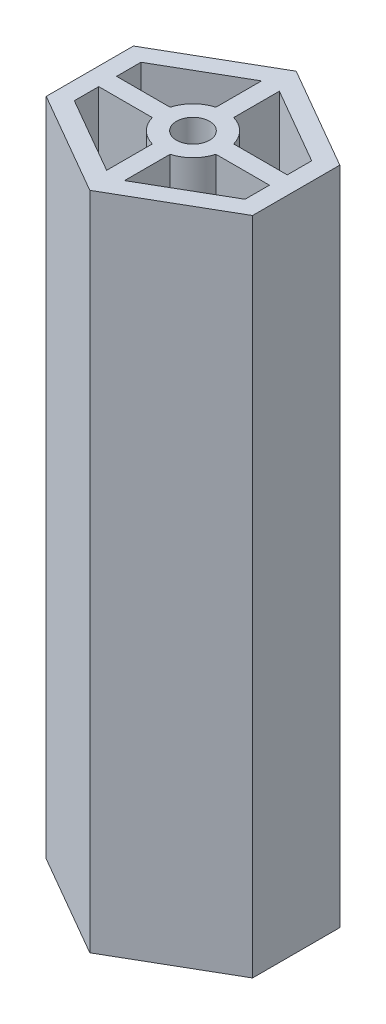
ISO-10303-21;
HEADER;
FILE_DESCRIPTION(('STEP AP214'),'2;1');
FILE_NAME('part.step','',(''),(''),'','','');
FILE_SCHEMA(('AUTOMOTIVE_DESIGN { 1 0 10303 214 1 1 1 1 }'));
ENDSEC;
DATA;
#1=APPLICATION_CONTEXT('core data for automotive mechanical design processes');
#2=APPLICATION_PROTOCOL_DEFINITION('international standard','automotive_design',2000,#1);
#3=PRODUCT_CONTEXT('',#1,'mechanical');
#4=PRODUCT('Part','Part','',(#3));
#5=PRODUCT_RELATED_PRODUCT_CATEGORY('part','',(#4));
#6=PRODUCT_DEFINITION_FORMATION('','',#4);
#7=PRODUCT_DEFINITION_CONTEXT('part definition',#1,'design');
#8=PRODUCT_DEFINITION('design','',#6,#7);
#9=PRODUCT_DEFINITION_SHAPE('','',#8);
#10=(LENGTH_UNIT() NAMED_UNIT(*) SI_UNIT(.MILLI.,.METRE.));
#11=(NAMED_UNIT(*) PLANE_ANGLE_UNIT() SI_UNIT($,.RADIAN.));
#12=(NAMED_UNIT(*) SI_UNIT($,.STERADIAN.) SOLID_ANGLE_UNIT());
#13=UNCERTAINTY_MEASURE_WITH_UNIT(LENGTH_MEASURE(1.E-05),#10,'distance_accuracy_value','');
#14=(GEOMETRIC_REPRESENTATION_CONTEXT(3) GLOBAL_UNCERTAINTY_ASSIGNED_CONTEXT((#13)) GLOBAL_UNIT_ASSIGNED_CONTEXT((#10,
#11,#12)) REPRESENTATION_CONTEXT('',''));
#15=CARTESIAN_POINT('',(0.,0.,0.));
#16=DIRECTION('',(0.,0.,1.));
#17=DIRECTION('',(1.,0.,0.));
#18=AXIS2_PLACEMENT_3D('',#15,#16,#17);
#19=CARTESIAN_POINT('',(0.,80.,0.));
#20=DIRECTION('',(0.,1.,0.));
#21=DIRECTION('',(0.,0.,1.));
#22=AXIS2_PLACEMENT_3D('',#19,#20,#21);
#23=PLANE('',#22);
#24=DIRECTION('',(0.,0.,-1.));
#25=VECTOR('',#24,1.);
#26=CARTESIAN_POINT('',(10.34,80.,1.08));
#27=LINE('',#26,#25);
#28=CARTESIAN_POINT('',(10.34,80.,4.03604505368013));
#29=VERTEX_POINT('',#28);
#30=CARTESIAN_POINT('',(10.34,80.,1.08));
#31=VERTEX_POINT('',#30);
#32=EDGE_CURVE('E218',#29,#31,#27,.T.);
#33=ORIENTED_EDGE('',*,*,#32,.F.);
#34=DIRECTION('',(0.866025403784439,0.,-0.5));
#35=VECTOR('',#34,1.);
#36=CARTESIAN_POINT('',(10.34,80.,4.03604505368013));
#37=LINE('',#36,#35);
#38=CARTESIAN_POINT('',(1.08,80.,9.38230854637606));
#39=VERTEX_POINT('',#38);
#40=EDGE_CURVE('E210',#39,#29,#37,.T.);
#41=ORIENTED_EDGE('',*,*,#40,.F.);
#42=DIRECTION('',(0.,0.,1.));
#43=VECTOR('',#42,1.);
#44=CARTESIAN_POINT('',(1.08,80.,3.85144128866065));
#45=LINE('',#44,#43);
#46=CARTESIAN_POINT('',(1.08,80.,3.85144128866065));
#47=VERTEX_POINT('',#46);
#48=EDGE_CURVE('E239',#47,#39,#45,.T.);
#49=ORIENTED_EDGE('',*,*,#48,.F.);
#50=CARTESIAN_POINT('',(0.,80.,0.));
#51=DIRECTION('',(0.,-1.,0.));
#52=DIRECTION('',(0.,0.,1.));
#53=AXIS2_PLACEMENT_3D('',#50,#51,#52);
#54=CIRCLE('',#53,4.);
#55=CARTESIAN_POINT('',(3.85144128866065,80.,1.08));
#56=VERTEX_POINT('',#55);
#57=EDGE_CURVE('E234',#56,#47,#54,.T.);
#58=ORIENTED_EDGE('',*,*,#57,.F.);
#59=DIRECTION('',(-1.,0.,0.));
#60=VECTOR('',#59,1.);
#61=CARTESIAN_POINT('',(3.85144128866065,80.,1.08));
#62=LINE('',#61,#60);
#63=EDGE_CURVE('E232',#31,#56,#62,.T.);
#64=ORIENTED_EDGE('',*,*,#63,.F.);
#65=EDGE_LOOP('',(#33,#41,#49,#58,#64));
#66=FACE_BOUND('',#65,.T.);
#67=DIRECTION('',(-1.,0.,0.));
#68=VECTOR('',#67,1.);
#69=CARTESIAN_POINT('',(-10.34,80.,1.08));
#70=LINE('',#69,#68);
#71=CARTESIAN_POINT('',(-3.85144128866065,80.,1.08));
#72=VERTEX_POINT('',#71);
#73=CARTESIAN_POINT('',(-10.34,80.,1.08));
#74=VERTEX_POINT('',#73);
#75=EDGE_CURVE('E259',#72,#74,#70,.T.);
#76=ORIENTED_EDGE('',*,*,#75,.F.);
#77=CARTESIAN_POINT('',(0.,80.,0.));
#78=DIRECTION('',(0.,-1.,0.));
#79=DIRECTION('',(0.,0.,1.));
#80=AXIS2_PLACEMENT_3D('',#77,#78,#79);
#81=CIRCLE('',#80,4.);
#82=CARTESIAN_POINT('',(-1.08,80.,3.85144128866065));
#83=VERTEX_POINT('',#82);
#84=EDGE_CURVE('E257',#83,#72,#81,.T.);
#85=ORIENTED_EDGE('',*,*,#84,.F.);
#86=DIRECTION('',(0.,0.,-1.));
#87=VECTOR('',#86,1.);
#88=CARTESIAN_POINT('',(-1.08,80.,3.85144128866065));
#89=LINE('',#88,#87);
#90=CARTESIAN_POINT('',(-1.08,80.,9.38230854637607));
#91=VERTEX_POINT('',#90);
#92=EDGE_CURVE('E267',#91,#83,#89,.T.);
#93=ORIENTED_EDGE('',*,*,#92,.F.);
#94=DIRECTION('',(0.866025403784439,0.,0.5));
#95=VECTOR('',#94,1.);
#96=CARTESIAN_POINT('',(-10.34,80.,4.03604505368013));
#97=LINE('',#96,#95);
#98=CARTESIAN_POINT('',(-10.34,80.,4.03604505368013));
#99=VERTEX_POINT('',#98);
#100=EDGE_CURVE('E264',#99,#91,#97,.T.);
#101=ORIENTED_EDGE('',*,*,#100,.F.);
#102=DIRECTION('',(0.,0.,1.));
#103=VECTOR('',#102,1.);
#104=CARTESIAN_POINT('',(-10.34,80.,1.08));
#105=LINE('',#104,#103);
#106=EDGE_CURVE('E262',#74,#99,#105,.T.);
#107=ORIENTED_EDGE('',*,*,#106,.F.);
#108=EDGE_LOOP('',(#76,#85,#93,#101,#107));
#109=FACE_BOUND('',#108,.T.);
#110=DIRECTION('',(0.,0.,-1.));
#111=VECTOR('',#110,1.);
#112=CARTESIAN_POINT('',(-1.08,80.,-9.38230854637594));
#113=LINE('',#112,#111);
#114=CARTESIAN_POINT('',(-1.08,80.,-3.85144128866065));
#115=VERTEX_POINT('',#114);
#116=CARTESIAN_POINT('',(-1.08,80.,-9.38230854637594));
#117=VERTEX_POINT('',#116);
#118=EDGE_CURVE('E297',#115,#117,#113,.T.);
#119=ORIENTED_EDGE('',*,*,#118,.F.);
#120=CARTESIAN_POINT('',(0.,80.,0.));
#121=DIRECTION('',(0.,-1.,0.));
#122=DIRECTION('',(0.,0.,1.));
#123=AXIS2_PLACEMENT_3D('',#120,#121,#122);
#124=CIRCLE('',#123,4.);
#125=CARTESIAN_POINT('',(-3.85144128866065,80.,-1.08));
#126=VERTEX_POINT('',#125);
#127=EDGE_CURVE('E295',#126,#115,#124,.T.);
#128=ORIENTED_EDGE('',*,*,#127,.F.);
#129=DIRECTION('',(1.,0.,0.));
#130=VECTOR('',#129,1.);
#131=CARTESIAN_POINT('',(-10.34,80.,-1.08));
#132=LINE('',#131,#130);
#133=CARTESIAN_POINT('',(-10.34,80.,-1.08));
#134=VERTEX_POINT('',#133);
#135=EDGE_CURVE('E305',#134,#126,#132,.T.);
#136=ORIENTED_EDGE('',*,*,#135,.F.);
#137=DIRECTION('',(0.,0.,1.));
#138=VECTOR('',#137,1.);
#139=CARTESIAN_POINT('',(-10.34,80.,-4.03604505368));
#140=LINE('',#139,#138);
#141=CARTESIAN_POINT('',(-10.34,80.,-4.03604505368));
#142=VERTEX_POINT('',#141);
#143=EDGE_CURVE('E302',#142,#134,#140,.T.);
#144=ORIENTED_EDGE('',*,*,#143,.F.);
#145=DIRECTION('',(-0.866025403784439,0.,0.5));
#146=VECTOR('',#145,1.);
#147=CARTESIAN_POINT('',(-10.34,80.,-4.03604505368));
#148=LINE('',#147,#146);
#149=EDGE_CURVE('E300',#117,#142,#148,.T.);
#150=ORIENTED_EDGE('',*,*,#149,.F.);
#151=EDGE_LOOP('',(#119,#128,#136,#144,#150));
#152=FACE_BOUND('',#151,.T.);
#153=DIRECTION('',(0.,0.,1.));
#154=VECTOR('',#153,1.);
#155=CARTESIAN_POINT('',(1.08,80.,-9.38230854637594));
#156=LINE('',#155,#154);
#157=CARTESIAN_POINT('',(1.08,80.,-9.38230854637594));
#158=VERTEX_POINT('',#157);
#159=CARTESIAN_POINT('',(1.08,80.,-3.85144128866065));
#160=VERTEX_POINT('',#159);
#161=EDGE_CURVE('E335',#158,#160,#156,.T.);
#162=ORIENTED_EDGE('',*,*,#161,.F.);
#163=DIRECTION('',(-0.866025403784439,0.,-0.5));
#164=VECTOR('',#163,1.);
#165=CARTESIAN_POINT('',(10.34,80.,-4.03604505368));
#166=LINE('',#165,#164);
#167=CARTESIAN_POINT('',(10.34,80.,-4.03604505368));
#168=VERTEX_POINT('',#167);
#169=EDGE_CURVE('E333',#168,#158,#166,.T.);
#170=ORIENTED_EDGE('',*,*,#169,.F.);
#171=DIRECTION('',(0.,0.,-1.));
#172=VECTOR('',#171,1.);
#173=CARTESIAN_POINT('',(10.34,80.,-4.03604505368));
#174=LINE('',#173,#172);
#175=CARTESIAN_POINT('',(10.34,80.,-1.08));
#176=VERTEX_POINT('',#175);
#177=EDGE_CURVE('E343',#176,#168,#174,.T.);
#178=ORIENTED_EDGE('',*,*,#177,.F.);
#179=DIRECTION('',(1.,0.,0.));
#180=VECTOR('',#179,1.);
#181=CARTESIAN_POINT('',(3.85144128866065,80.,-1.08));
#182=LINE('',#181,#180);
#183=CARTESIAN_POINT('',(3.85144128866065,80.,-1.08));
#184=VERTEX_POINT('',#183);
#185=EDGE_CURVE('E340',#184,#176,#182,.T.);
#186=ORIENTED_EDGE('',*,*,#185,.F.);
#187=CARTESIAN_POINT('',(0.,80.,0.));
#188=DIRECTION('',(0.,-1.,0.));
#189=DIRECTION('',(0.,0.,1.));
#190=AXIS2_PLACEMENT_3D('',#187,#188,#189);
#191=CIRCLE('',#190,4.);
#192=EDGE_CURVE('E338',#160,#184,#191,.T.);
#193=ORIENTED_EDGE('',*,*,#192,.F.);
#194=EDGE_LOOP('',(#162,#170,#178,#186,#193));
#195=FACE_BOUND('',#194,.T.);
#196=DIRECTION('',(-0.866025403784436,0.,0.500000000000004));
#197=VECTOR('',#196,1.);
#198=CARTESIAN_POINT('',(-12.5,80.,-5.28312163512959));
#199=LINE('',#198,#197);
#200=CARTESIAN_POINT('',(0.,80.,-12.5));
#201=VERTEX_POINT('',#200);
#202=CARTESIAN_POINT('',(-12.5,80.,-5.28312163512959));
#203=VERTEX_POINT('',#202);
#204=EDGE_CURVE('E371',#201,#203,#199,.T.);
#205=ORIENTED_EDGE('',*,*,#204,.T.);
#206=DIRECTION('',(0.,0.,1.));
#207=VECTOR('',#206,1.);
#208=CARTESIAN_POINT('',(-12.5,80.,-5.28312163512959));
#209=LINE('',#208,#207);
#210=CARTESIAN_POINT('',(-12.5,80.,5.28312163512973));
#211=VERTEX_POINT('',#210);
#212=EDGE_CURVE('E374',#203,#211,#209,.T.);
#213=ORIENTED_EDGE('',*,*,#212,.T.);
#214=DIRECTION('',(0.86602540378444,0.,0.499999999999998));
#215=VECTOR('',#214,1.);
#216=CARTESIAN_POINT('',(-12.5,80.,5.28312163512973));
#217=LINE('',#216,#215);
#218=CARTESIAN_POINT('',(0.,80.,12.5));
#219=VERTEX_POINT('',#218);
#220=EDGE_CURVE('E377',#211,#219,#217,.T.);
#221=ORIENTED_EDGE('',*,*,#220,.T.);
#222=DIRECTION('',(0.86602540378444,0.,-0.499999999999998));
#223=VECTOR('',#222,1.);
#224=CARTESIAN_POINT('',(12.5,80.,5.28312163512972));
#225=LINE('',#224,#223);
#226=CARTESIAN_POINT('',(12.5,80.,5.28312163512972));
#227=VERTEX_POINT('',#226);
#228=EDGE_CURVE('E379',#219,#227,#225,.T.);
#229=ORIENTED_EDGE('',*,*,#228,.T.);
#230=DIRECTION('',(0.,0.,-1.));
#231=VECTOR('',#230,1.);
#232=CARTESIAN_POINT('',(12.5,80.,-5.28312163512959));
#233=LINE('',#232,#231);
#234=CARTESIAN_POINT('',(12.5,80.,-5.28312163512959));
#235=VERTEX_POINT('',#234);
#236=EDGE_CURVE('E381',#227,#235,#233,.T.);
#237=ORIENTED_EDGE('',*,*,#236,.T.);
#238=DIRECTION('',(-0.866025403784436,0.,-0.500000000000004));
#239=VECTOR('',#238,1.);
#240=CARTESIAN_POINT('',(12.5,80.,-5.28312163512959));
#241=LINE('',#240,#239);
#242=EDGE_CURVE('E383',#235,#201,#241,.T.);
#243=ORIENTED_EDGE('',*,*,#242,.T.);
#244=EDGE_LOOP('',(#205,#213,#221,#229,#237,#243));
#245=FACE_BOUND('',#244,.T.);
#246=CARTESIAN_POINT('',(0.,80.,0.));
#247=DIRECTION('',(0.,1.,0.));
#248=DIRECTION('',(0.,0.,1.));
#249=AXIS2_PLACEMENT_3D('',#246,#247,#248);
#250=CIRCLE('',#249,2.);
#251=CARTESIAN_POINT('',(0.,80.,2.));
#252=VERTEX_POINT('',#251);
#253=EDGE_CURVE('E242',#252,#252,#250,.T.);
#254=ORIENTED_EDGE('',*,*,#253,.F.);
#255=EDGE_LOOP('',(#254));
#256=FACE_BOUND('',#255,.T.);
#257=ADVANCED_FACE('F37',(#66,#109,#152,#195,#245,#256),#23,.T.);
#258=CARTESIAN_POINT('',(0.,0.,0.));
#259=DIRECTION('',(0.,1.,0.));
#260=DIRECTION('',(0.,0.,1.));
#261=AXIS2_PLACEMENT_3D('',#258,#259,#260);
#262=PLANE('',#261);
#263=CARTESIAN_POINT('',(0.,0.,0.));
#264=DIRECTION('',(0.,-1.,0.));
#265=DIRECTION('',(0.,0.,1.));
#266=AXIS2_PLACEMENT_3D('',#263,#264,#265);
#267=CIRCLE('',#266,4.);
#268=CARTESIAN_POINT('',(-1.08,0.,3.85144128866065));
#269=VERTEX_POINT('',#268);
#270=CARTESIAN_POINT('',(-3.85144128866065,0.,1.08));
#271=VERTEX_POINT('',#270);
#272=EDGE_CURVE('E226',#269,#271,#267,.T.);
#273=ORIENTED_EDGE('',*,*,#272,.T.);
#274=DIRECTION('',(-1.,0.,0.));
#275=VECTOR('',#274,1.);
#276=CARTESIAN_POINT('',(-10.34,0.,1.08));
#277=LINE('',#276,#275);
#278=CARTESIAN_POINT('',(-10.34,0.,1.08));
#279=VERTEX_POINT('',#278);
#280=EDGE_CURVE('E272',#271,#279,#277,.T.);
#281=ORIENTED_EDGE('',*,*,#280,.T.);
#282=DIRECTION('',(0.,0.,1.));
#283=VECTOR('',#282,1.);
#284=CARTESIAN_POINT('',(-10.34,0.,1.08));
#285=LINE('',#284,#283);
#286=CARTESIAN_POINT('',(-10.34,0.,4.03604505368013));
#287=VERTEX_POINT('',#286);
#288=EDGE_CURVE('E275',#279,#287,#285,.T.);
#289=ORIENTED_EDGE('',*,*,#288,.T.);
#290=DIRECTION('',(0.866025403784439,0.,0.5));
#291=VECTOR('',#290,1.);
#292=CARTESIAN_POINT('',(-10.34,0.,4.03604505368013));
#293=LINE('',#292,#291);
#294=CARTESIAN_POINT('',(-1.08,0.,9.38230854637607));
#295=VERTEX_POINT('',#294);
#296=EDGE_CURVE('E278',#287,#295,#293,.T.);
#297=ORIENTED_EDGE('',*,*,#296,.T.);
#298=DIRECTION('',(0.,0.,-1.));
#299=VECTOR('',#298,1.);
#300=CARTESIAN_POINT('',(-1.08,0.,3.85144128866065));
#301=LINE('',#300,#299);
#302=EDGE_CURVE('E260',#295,#269,#301,.T.);
#303=ORIENTED_EDGE('',*,*,#302,.T.);
#304=EDGE_LOOP('',(#273,#281,#289,#297,#303));
#305=FACE_BOUND('',#304,.T.);
#306=DIRECTION('',(-0.866025403784439,0.,-0.5));
#307=VECTOR('',#306,1.);
#308=CARTESIAN_POINT('',(10.34,0.,-4.03604505368));
#309=LINE('',#308,#307);
#310=CARTESIAN_POINT('',(10.34,0.,-4.03604505368));
#311=VERTEX_POINT('',#310);
#312=CARTESIAN_POINT('',(1.08,0.,-9.38230854637594));
#313=VERTEX_POINT('',#312);
#314=EDGE_CURVE('E332',#311,#313,#309,.T.);
#315=ORIENTED_EDGE('',*,*,#314,.T.);
#316=DIRECTION('',(0.,0.,1.));
#317=VECTOR('',#316,1.);
#318=CARTESIAN_POINT('',(1.08,0.,-9.38230854637594));
#319=LINE('',#318,#317);
#320=CARTESIAN_POINT('',(1.08,0.,-3.85144128866065));
#321=VERTEX_POINT('',#320);
#322=EDGE_CURVE('E348',#313,#321,#319,.T.);
#323=ORIENTED_EDGE('',*,*,#322,.T.);
#324=CARTESIAN_POINT('',(0.,0.,0.));
#325=DIRECTION('',(0.,-1.,0.));
#326=DIRECTION('',(0.,0.,1.));
#327=AXIS2_PLACEMENT_3D('',#324,#325,#326);
#328=CIRCLE('',#327,4.);
#329=CARTESIAN_POINT('',(3.85144128866065,0.,-1.08));
#330=VERTEX_POINT('',#329);
#331=EDGE_CURVE('E351',#321,#330,#328,.T.);
#332=ORIENTED_EDGE('',*,*,#331,.T.);
#333=DIRECTION('',(1.,0.,0.));
#334=VECTOR('',#333,1.);
#335=CARTESIAN_POINT('',(3.85144128866065,0.,-1.08));
#336=LINE('',#335,#334);
#337=CARTESIAN_POINT('',(10.34,0.,-1.08));
#338=VERTEX_POINT('',#337);
#339=EDGE_CURVE('E354',#330,#338,#336,.T.);
#340=ORIENTED_EDGE('',*,*,#339,.T.);
#341=DIRECTION('',(0.,0.,-1.));
#342=VECTOR('',#341,1.);
#343=CARTESIAN_POINT('',(10.34,0.,-4.03604505368));
#344=LINE('',#343,#342);
#345=EDGE_CURVE('E336',#338,#311,#344,.T.);
#346=ORIENTED_EDGE('',*,*,#345,.T.);
#347=EDGE_LOOP('',(#315,#323,#332,#340,#346));
#348=FACE_BOUND('',#347,.T.);
#349=DIRECTION('',(-0.866025403784436,0.,0.500000000000004));
#350=VECTOR('',#349,1.);
#351=CARTESIAN_POINT('',(-12.5,0.,-5.28312163512959));
#352=LINE('',#351,#350);
#353=CARTESIAN_POINT('',(0.,0.,-12.5));
#354=VERTEX_POINT('',#353);
#355=CARTESIAN_POINT('',(-12.5,0.,-5.28312163512959));
#356=VERTEX_POINT('',#355);
#357=EDGE_CURVE('E370',#354,#356,#352,.T.);
#358=ORIENTED_EDGE('',*,*,#357,.F.);
#359=DIRECTION('',(-0.866025403784436,0.,-0.500000000000004));
#360=VECTOR('',#359,1.);
#361=CARTESIAN_POINT('',(12.5,0.,-5.28312163512959));
#362=LINE('',#361,#360);
#363=CARTESIAN_POINT('',(12.5,0.,-5.28312163512959));
#364=VERTEX_POINT('',#363);
#365=EDGE_CURVE('E375',#364,#354,#362,.T.);
#366=ORIENTED_EDGE('',*,*,#365,.F.);
#367=DIRECTION('',(0.,0.,-1.));
#368=VECTOR('',#367,1.);
#369=CARTESIAN_POINT('',(12.5,0.,-5.28312163512959));
#370=LINE('',#369,#368);
#371=CARTESIAN_POINT('',(12.5,0.,5.28312163512972));
#372=VERTEX_POINT('',#371);
#373=EDGE_CURVE('E394',#372,#364,#370,.T.);
#374=ORIENTED_EDGE('',*,*,#373,.F.);
#375=DIRECTION('',(0.86602540378444,0.,-0.499999999999998));
#376=VECTOR('',#375,1.);
#377=CARTESIAN_POINT('',(12.5,0.,5.28312163512972));
#378=LINE('',#377,#376);
#379=CARTESIAN_POINT('',(0.,0.,12.5));
#380=VERTEX_POINT('',#379);
#381=EDGE_CURVE('E392',#380,#372,#378,.T.);
#382=ORIENTED_EDGE('',*,*,#381,.F.);
#383=DIRECTION('',(0.86602540378444,0.,0.499999999999998));
#384=VECTOR('',#383,1.);
#385=CARTESIAN_POINT('',(-12.5,0.,5.28312163512973));
#386=LINE('',#385,#384);
#387=CARTESIAN_POINT('',(-12.5,0.,5.28312163512973));
#388=VERTEX_POINT('',#387);
#389=EDGE_CURVE('E390',#388,#380,#386,.T.);
#390=ORIENTED_EDGE('',*,*,#389,.F.);
#391=DIRECTION('',(0.,0.,1.));
#392=VECTOR('',#391,1.);
#393=CARTESIAN_POINT('',(-12.5,0.,-5.28312163512959));
#394=LINE('',#393,#392);
#395=EDGE_CURVE('E388',#356,#388,#394,.T.);
#396=ORIENTED_EDGE('',*,*,#395,.F.);
#397=EDGE_LOOP('',(#358,#366,#374,#382,#390,#396));
#398=FACE_BOUND('',#397,.T.);
#399=CARTESIAN_POINT('',(0.,0.,0.));
#400=DIRECTION('',(0.,-1.,0.));
#401=DIRECTION('',(0.,0.,1.));
#402=AXIS2_PLACEMENT_3D('',#399,#400,#401);
#403=CIRCLE('',#402,4.);
#404=CARTESIAN_POINT('',(-3.85144128866065,0.,-1.08));
#405=VERTEX_POINT('',#404);
#406=CARTESIAN_POINT('',(-1.08,0.,-3.85144128866065));
#407=VERTEX_POINT('',#406);
#408=EDGE_CURVE('E294',#405,#407,#403,.T.);
#409=ORIENTED_EDGE('',*,*,#408,.T.);
#410=DIRECTION('',(0.,0.,-1.));
#411=VECTOR('',#410,1.);
#412=CARTESIAN_POINT('',(-1.08,0.,-9.38230854637594));
#413=LINE('',#412,#411);
#414=CARTESIAN_POINT('',(-1.08,0.,-9.38230854637594));
#415=VERTEX_POINT('',#414);
#416=EDGE_CURVE('E310',#407,#415,#413,.T.);
#417=ORIENTED_EDGE('',*,*,#416,.T.);
#418=DIRECTION('',(-0.866025403784439,0.,0.5));
#419=VECTOR('',#418,1.);
#420=CARTESIAN_POINT('',(-10.34,0.,-4.03604505368));
#421=LINE('',#420,#419);
#422=CARTESIAN_POINT('',(-10.34,0.,-4.03604505368));
#423=VERTEX_POINT('',#422);
#424=EDGE_CURVE('E313',#415,#423,#421,.T.);
#425=ORIENTED_EDGE('',*,*,#424,.T.);
#426=DIRECTION('',(0.,0.,1.));
#427=VECTOR('',#426,1.);
#428=CARTESIAN_POINT('',(-10.34,0.,-4.03604505368));
#429=LINE('',#428,#427);
#430=CARTESIAN_POINT('',(-10.34,0.,-1.08));
#431=VERTEX_POINT('',#430);
#432=EDGE_CURVE('E316',#423,#431,#429,.T.);
#433=ORIENTED_EDGE('',*,*,#432,.T.);
#434=DIRECTION('',(1.,0.,0.));
#435=VECTOR('',#434,1.);
#436=CARTESIAN_POINT('',(-10.34,0.,-1.08));
#437=LINE('',#436,#435);
#438=EDGE_CURVE('E298',#431,#405,#437,.T.);
#439=ORIENTED_EDGE('',*,*,#438,.T.);
#440=EDGE_LOOP('',(#409,#417,#425,#433,#439));
#441=FACE_BOUND('',#440,.T.);
#442=DIRECTION('',(0.866025403784439,0.,-0.5));
#443=VECTOR('',#442,1.);
#444=CARTESIAN_POINT('',(10.34,0.,4.03604505368013));
#445=LINE('',#444,#443);
#446=CARTESIAN_POINT('',(1.08,0.,9.38230854637606));
#447=VERTEX_POINT('',#446);
#448=CARTESIAN_POINT('',(10.34,0.,4.03604505368013));
#449=VERTEX_POINT('',#448);
#450=EDGE_CURVE('E60',#447,#449,#445,.T.);
#451=ORIENTED_EDGE('',*,*,#450,.T.);
#452=DIRECTION('',(0.,0.,-1.));
#453=VECTOR('',#452,1.);
#454=CARTESIAN_POINT('',(10.34,0.,1.08));
#455=LINE('',#454,#453);
#456=CARTESIAN_POINT('',(10.34,0.,1.08));
#457=VERTEX_POINT('',#456);
#458=EDGE_CURVE('E225',#449,#457,#455,.T.);
#459=ORIENTED_EDGE('',*,*,#458,.T.);
#460=DIRECTION('',(-1.,0.,0.));
#461=VECTOR('',#460,1.);
#462=CARTESIAN_POINT('',(3.85144128866065,0.,1.08));
#463=LINE('',#462,#461);
#464=CARTESIAN_POINT('',(3.85144128866065,0.,1.08));
#465=VERTEX_POINT('',#464);
#466=EDGE_CURVE('E244',#457,#465,#463,.T.);
#467=ORIENTED_EDGE('',*,*,#466,.T.);
#468=CARTESIAN_POINT('',(0.,0.,0.));
#469=DIRECTION('',(0.,-1.,0.));
#470=DIRECTION('',(0.,0.,1.));
#471=AXIS2_PLACEMENT_3D('',#468,#469,#470);
#472=CIRCLE('',#471,4.);
#473=CARTESIAN_POINT('',(1.08,0.,3.85144128866065));
#474=VERTEX_POINT('',#473);
#475=EDGE_CURVE('E247',#465,#474,#472,.T.);
#476=ORIENTED_EDGE('',*,*,#475,.T.);
#477=DIRECTION('',(0.,0.,1.));
#478=VECTOR('',#477,1.);
#479=CARTESIAN_POINT('',(1.08,0.,3.85144128866065));
#480=LINE('',#479,#478);
#481=EDGE_CURVE('E219',#474,#447,#480,.T.);
#482=ORIENTED_EDGE('',*,*,#481,.T.);
#483=EDGE_LOOP('',(#451,#459,#467,#476,#482));
#484=FACE_BOUND('',#483,.T.);
#485=CARTESIAN_POINT('',(0.,0.,0.));
#486=DIRECTION('',(0.,1.,0.));
#487=DIRECTION('',(0.,0.,1.));
#488=AXIS2_PLACEMENT_3D('',#485,#486,#487);
#489=CIRCLE('',#488,2.);
#490=CARTESIAN_POINT('',(0.,0.,2.));
#491=VERTEX_POINT('',#490);
#492=EDGE_CURVE('E539',#491,#491,#489,.T.);
#493=ORIENTED_EDGE('',*,*,#492,.T.);
#494=EDGE_LOOP('',(#493));
#495=FACE_BOUND('',#494,.T.);
#496=ADVANCED_FACE('F418',(#305,#348,#398,#441,#484,#495),#262,.F.);
#497=CARTESIAN_POINT('',(-12.5,80.,-5.28312163512959));
#498=DIRECTION('',(0.500000000000004,0.,0.866025403784436));
#499=DIRECTION('',(0.866025403784436,0.,-0.500000000000004));
#500=AXIS2_PLACEMENT_3D('',#497,#498,#499);
#501=PLANE('',#500);
#502=ORIENTED_EDGE('',*,*,#357,.T.);
#503=DIRECTION('',(0.,-1.,0.));
#504=VECTOR('',#503,1.);
#505=CARTESIAN_POINT('',(-12.5,80.,-5.28312163512959));
#506=LINE('',#505,#504);
#507=EDGE_CURVE('E11',#203,#356,#506,.T.);
#508=ORIENTED_EDGE('',*,*,#507,.F.);
#509=ORIENTED_EDGE('',*,*,#204,.F.);
#510=DIRECTION('',(0.,-1.,0.));
#511=VECTOR('',#510,1.);
#512=CARTESIAN_POINT('',(0.,80.,-12.5));
#513=LINE('',#512,#511);
#514=EDGE_CURVE('E385',#201,#354,#513,.T.);
#515=ORIENTED_EDGE('',*,*,#514,.T.);
#516=EDGE_LOOP('',(#502,#508,#509,#515));
#517=FACE_BOUND('',#516,.T.);
#518=ADVANCED_FACE('F39',(#517),#501,.F.);
#519=CARTESIAN_POINT('',(-12.5,80.,-5.28312163512959));
#520=DIRECTION('',(1.,0.,0.));
#521=DIRECTION('',(0.,0.,-1.));
#522=AXIS2_PLACEMENT_3D('',#519,#520,#521);
#523=PLANE('',#522);
#524=ORIENTED_EDGE('',*,*,#395,.T.);
#525=DIRECTION('',(0.,-1.,0.));
#526=VECTOR('',#525,1.);
#527=CARTESIAN_POINT('',(-12.5,80.,5.28312163512973));
#528=LINE('',#527,#526);
#529=EDGE_CURVE('E45',#211,#388,#528,.T.);
#530=ORIENTED_EDGE('',*,*,#529,.F.);
#531=ORIENTED_EDGE('',*,*,#212,.F.);
#532=ORIENTED_EDGE('',*,*,#507,.T.);
#533=EDGE_LOOP('',(#524,#530,#531,#532));
#534=FACE_BOUND('',#533,.T.);
#535=ADVANCED_FACE('F436',(#534),#523,.F.);
#536=CARTESIAN_POINT('',(-12.5,80.,5.28312163512973));
#537=DIRECTION('',(0.499999999999998,0.,-0.86602540378444));
#538=DIRECTION('',(-0.86602540378444,0.,-0.499999999999998));
#539=AXIS2_PLACEMENT_3D('',#536,#537,#538);
#540=PLANE('',#539);
#541=ORIENTED_EDGE('',*,*,#389,.T.);
#542=DIRECTION('',(0.,-1.,0.));
#543=VECTOR('',#542,1.);
#544=CARTESIAN_POINT('',(0.,80.,12.5));
#545=LINE('',#544,#543);
#546=EDGE_CURVE('E405',#219,#380,#545,.T.);
#547=ORIENTED_EDGE('',*,*,#546,.F.);
#548=ORIENTED_EDGE('',*,*,#220,.F.);
#549=ORIENTED_EDGE('',*,*,#529,.T.);
#550=EDGE_LOOP('',(#541,#547,#548,#549));
#551=FACE_BOUND('',#550,.T.);
#552=ADVANCED_FACE('F412',(#551),#540,.F.);
#553=CARTESIAN_POINT('',(12.5,80.,5.28312163512972));
#554=DIRECTION('',(-0.499999999999998,0.,-0.86602540378444));
#555=DIRECTION('',(-0.86602540378444,0.,0.499999999999998));
#556=AXIS2_PLACEMENT_3D('',#553,#554,#555);
#557=PLANE('',#556);
#558=ORIENTED_EDGE('',*,*,#381,.T.);
#559=DIRECTION('',(0.,-1.,0.));
#560=VECTOR('',#559,1.);
#561=CARTESIAN_POINT('',(12.5,80.,5.28312163512972));
#562=LINE('',#561,#560);
#563=EDGE_CURVE('E402',#227,#372,#562,.T.);
#564=ORIENTED_EDGE('',*,*,#563,.F.);
#565=ORIENTED_EDGE('',*,*,#228,.F.);
#566=ORIENTED_EDGE('',*,*,#546,.T.);
#567=EDGE_LOOP('',(#558,#564,#565,#566));
#568=FACE_BOUND('',#567,.T.);
#569=ADVANCED_FACE('F424',(#568),#557,.F.);
#570=CARTESIAN_POINT('',(12.5,80.,-5.28312163512959));
#571=DIRECTION('',(-1.,0.,0.));
#572=DIRECTION('',(0.,0.,1.));
#573=AXIS2_PLACEMENT_3D('',#570,#571,#572);
#574=PLANE('',#573);
#575=ORIENTED_EDGE('',*,*,#373,.T.);
#576=DIRECTION('',(0.,-1.,0.));
#577=VECTOR('',#576,1.);
#578=CARTESIAN_POINT('',(12.5,80.,-5.28312163512959));
#579=LINE('',#578,#577);
#580=EDGE_CURVE('E399',#235,#364,#579,.T.);
#581=ORIENTED_EDGE('',*,*,#580,.F.);
#582=ORIENTED_EDGE('',*,*,#236,.F.);
#583=ORIENTED_EDGE('',*,*,#563,.T.);
#584=EDGE_LOOP('',(#575,#581,#582,#583));
#585=FACE_BOUND('',#584,.T.);
#586=ADVANCED_FACE('F428',(#585),#574,.F.);
#587=CARTESIAN_POINT('',(12.5,80.,-5.28312163512959));
#588=DIRECTION('',(-0.500000000000004,0.,0.866025403784436));
#589=DIRECTION('',(0.866025403784436,0.,0.500000000000004));
#590=AXIS2_PLACEMENT_3D('',#587,#588,#589);
#591=PLANE('',#590);
#592=ORIENTED_EDGE('',*,*,#365,.T.);
#593=ORIENTED_EDGE('',*,*,#514,.F.);
#594=ORIENTED_EDGE('',*,*,#242,.F.);
#595=ORIENTED_EDGE('',*,*,#580,.T.);
#596=EDGE_LOOP('',(#592,#593,#594,#595));
#597=FACE_BOUND('',#596,.T.);
#598=ADVANCED_FACE('F439',(#597),#591,.F.);
#599=CARTESIAN_POINT('',(10.34,80.,-4.03604505368));
#600=DIRECTION('',(-0.5,0.,0.866025403784439));
#601=DIRECTION('',(0.866025403784439,0.,0.5));
#602=AXIS2_PLACEMENT_3D('',#599,#600,#601);
#603=PLANE('',#602);
#604=ORIENTED_EDGE('',*,*,#314,.F.);
#605=DIRECTION('',(0.,-1.,0.));
#606=VECTOR('',#605,1.);
#607=CARTESIAN_POINT('',(10.34,80.,-4.03604505368));
#608=LINE('',#607,#606);
#609=EDGE_CURVE('E345',#168,#311,#608,.T.);
#610=ORIENTED_EDGE('',*,*,#609,.F.);
#611=ORIENTED_EDGE('',*,*,#169,.T.);
#612=DIRECTION('',(0.,-1.,0.));
#613=VECTOR('',#612,1.);
#614=CARTESIAN_POINT('',(1.08,80.,-9.38230854637594));
#615=LINE('',#614,#613);
#616=EDGE_CURVE('E367',#158,#313,#615,.T.);
#617=ORIENTED_EDGE('',*,*,#616,.T.);
#618=EDGE_LOOP('',(#604,#610,#611,#617));
#619=FACE_BOUND('',#618,.T.);
#620=ADVANCED_FACE('F441',(#619),#603,.T.);
#621=CARTESIAN_POINT('',(1.08,80.,-9.38230854637594));
#622=DIRECTION('',(1.,0.,0.));
#623=DIRECTION('',(0.,0.,-1.));
#624=AXIS2_PLACEMENT_3D('',#621,#622,#623);
#625=PLANE('',#624);
#626=ORIENTED_EDGE('',*,*,#322,.F.);
#627=ORIENTED_EDGE('',*,*,#616,.F.);
#628=ORIENTED_EDGE('',*,*,#161,.T.);
#629=DIRECTION('',(0.,-1.,0.));
#630=VECTOR('',#629,1.);
#631=CARTESIAN_POINT('',(1.08,80.,-3.85144128866065));
#632=LINE('',#631,#630);
#633=EDGE_CURVE('E365',#160,#321,#632,.T.);
#634=ORIENTED_EDGE('',*,*,#633,.T.);
#635=EDGE_LOOP('',(#626,#627,#628,#634));
#636=FACE_BOUND('',#635,.T.);
#637=ADVANCED_FACE('F447',(#636),#625,.T.);
#638=CARTESIAN_POINT('',(0.,80.,0.));
#639=DIRECTION('',(0.,-1.,0.));
#640=DIRECTION('',(0.,0.,-1.));
#641=AXIS2_PLACEMENT_3D('',#638,#639,#640);
#642=CYLINDRICAL_SURFACE('',#641,4.);
#643=ORIENTED_EDGE('',*,*,#331,.F.);
#644=ORIENTED_EDGE('',*,*,#633,.F.);
#645=ORIENTED_EDGE('',*,*,#192,.T.);
#646=DIRECTION('',(0.,-1.,0.));
#647=VECTOR('',#646,1.);
#648=CARTESIAN_POINT('',(3.85144128866065,80.,-1.08));
#649=LINE('',#648,#647);
#650=EDGE_CURVE('E363',#184,#330,#649,.T.);
#651=ORIENTED_EDGE('',*,*,#650,.T.);
#652=EDGE_LOOP('',(#643,#644,#645,#651));
#653=FACE_BOUND('',#652,.T.);
#654=ADVANCED_FACE('F461',(#653),#642,.T.);
#655=CARTESIAN_POINT('',(3.85144128866065,80.,-1.08));
#656=DIRECTION('',(0.,0.,-1.));
#657=DIRECTION('',(-1.,0.,0.));
#658=AXIS2_PLACEMENT_3D('',#655,#656,#657);
#659=PLANE('',#658);
#660=ORIENTED_EDGE('',*,*,#339,.F.);
#661=ORIENTED_EDGE('',*,*,#650,.F.);
#662=ORIENTED_EDGE('',*,*,#185,.T.);
#663=DIRECTION('',(0.,-1.,0.));
#664=VECTOR('',#663,1.);
#665=CARTESIAN_POINT('',(10.34,80.,-1.08));
#666=LINE('',#665,#664);
#667=EDGE_CURVE('E361',#176,#338,#666,.T.);
#668=ORIENTED_EDGE('',*,*,#667,.T.);
#669=EDGE_LOOP('',(#660,#661,#662,#668));
#670=FACE_BOUND('',#669,.T.);
#671=ADVANCED_FACE('F465',(#670),#659,.T.);
#672=CARTESIAN_POINT('',(10.34,80.,-4.03604505368));
#673=DIRECTION('',(-1.,0.,0.));
#674=DIRECTION('',(0.,0.,1.));
#675=AXIS2_PLACEMENT_3D('',#672,#673,#674);
#676=PLANE('',#675);
#677=ORIENTED_EDGE('',*,*,#345,.F.);
#678=ORIENTED_EDGE('',*,*,#667,.F.);
#679=ORIENTED_EDGE('',*,*,#177,.T.);
#680=ORIENTED_EDGE('',*,*,#609,.T.);
#681=EDGE_LOOP('',(#677,#678,#679,#680));
#682=FACE_BOUND('',#681,.T.);
#683=ADVANCED_FACE('F469',(#682),#676,.T.);
#684=CARTESIAN_POINT('',(0.,80.,0.));
#685=DIRECTION('',(0.,-1.,0.));
#686=DIRECTION('',(0.,0.,-1.));
#687=AXIS2_PLACEMENT_3D('',#684,#685,#686);
#688=CYLINDRICAL_SURFACE('',#687,4.);
#689=ORIENTED_EDGE('',*,*,#408,.F.);
#690=DIRECTION('',(0.,-1.,0.));
#691=VECTOR('',#690,1.);
#692=CARTESIAN_POINT('',(-3.85144128866065,80.,-1.08));
#693=LINE('',#692,#691);
#694=EDGE_CURVE('E307',#126,#405,#693,.T.);
#695=ORIENTED_EDGE('',*,*,#694,.F.);
#696=ORIENTED_EDGE('',*,*,#127,.T.);
#697=DIRECTION('',(0.,-1.,0.));
#698=VECTOR('',#697,1.);
#699=CARTESIAN_POINT('',(-1.08,80.,-3.85144128866065));
#700=LINE('',#699,#698);
#701=EDGE_CURVE('E329',#115,#407,#700,.T.);
#702=ORIENTED_EDGE('',*,*,#701,.T.);
#703=EDGE_LOOP('',(#689,#695,#696,#702));
#704=FACE_BOUND('',#703,.T.);
#705=ADVANCED_FACE('F473',(#704),#688,.T.);
#706=CARTESIAN_POINT('',(-1.08,80.,-9.38230854637594));
#707=DIRECTION('',(-1.,0.,0.));
#708=DIRECTION('',(0.,0.,1.));
#709=AXIS2_PLACEMENT_3D('',#706,#707,#708);
#710=PLANE('',#709);
#711=ORIENTED_EDGE('',*,*,#416,.F.);
#712=ORIENTED_EDGE('',*,*,#701,.F.);
#713=ORIENTED_EDGE('',*,*,#118,.T.);
#714=DIRECTION('',(0.,-1.,0.));
#715=VECTOR('',#714,1.);
#716=CARTESIAN_POINT('',(-1.08,80.,-9.38230854637594));
#717=LINE('',#716,#715);
#718=EDGE_CURVE('E327',#117,#415,#717,.T.);
#719=ORIENTED_EDGE('',*,*,#718,.T.);
#720=EDGE_LOOP('',(#711,#712,#713,#719));
#721=FACE_BOUND('',#720,.T.);
#722=ADVANCED_FACE('F477',(#721),#710,.T.);
#723=CARTESIAN_POINT('',(-10.34,80.,-4.03604505368));
#724=DIRECTION('',(0.5,0.,0.866025403784439));
#725=DIRECTION('',(0.866025403784439,0.,-0.5));
#726=AXIS2_PLACEMENT_3D('',#723,#724,#725);
#727=PLANE('',#726);
#728=ORIENTED_EDGE('',*,*,#424,.F.);
#729=ORIENTED_EDGE('',*,*,#718,.F.);
#730=ORIENTED_EDGE('',*,*,#149,.T.);
#731=DIRECTION('',(0.,-1.,0.));
#732=VECTOR('',#731,1.);
#733=CARTESIAN_POINT('',(-10.34,80.,-4.03604505368));
#734=LINE('',#733,#732);
#735=EDGE_CURVE('E325',#142,#423,#734,.T.);
#736=ORIENTED_EDGE('',*,*,#735,.T.);
#737=EDGE_LOOP('',(#728,#729,#730,#736));
#738=FACE_BOUND('',#737,.T.);
#739=ADVANCED_FACE('F481',(#738),#727,.T.);
#740=CARTESIAN_POINT('',(-10.34,80.,-4.03604505368));
#741=DIRECTION('',(1.,0.,0.));
#742=DIRECTION('',(0.,0.,-1.));
#743=AXIS2_PLACEMENT_3D('',#740,#741,#742);
#744=PLANE('',#743);
#745=ORIENTED_EDGE('',*,*,#432,.F.);
#746=ORIENTED_EDGE('',*,*,#735,.F.);
#747=ORIENTED_EDGE('',*,*,#143,.T.);
#748=DIRECTION('',(0.,-1.,0.));
#749=VECTOR('',#748,1.);
#750=CARTESIAN_POINT('',(-10.34,80.,-1.08));
#751=LINE('',#750,#749);
#752=EDGE_CURVE('E323',#134,#431,#751,.T.);
#753=ORIENTED_EDGE('',*,*,#752,.T.);
#754=EDGE_LOOP('',(#745,#746,#747,#753));
#755=FACE_BOUND('',#754,.T.);
#756=ADVANCED_FACE('F485',(#755),#744,.T.);
#757=CARTESIAN_POINT('',(-10.34,80.,-1.08));
#758=DIRECTION('',(0.,0.,-1.));
#759=DIRECTION('',(-1.,0.,0.));
#760=AXIS2_PLACEMENT_3D('',#757,#758,#759);
#761=PLANE('',#760);
#762=ORIENTED_EDGE('',*,*,#438,.F.);
#763=ORIENTED_EDGE('',*,*,#752,.F.);
#764=ORIENTED_EDGE('',*,*,#135,.T.);
#765=ORIENTED_EDGE('',*,*,#694,.T.);
#766=EDGE_LOOP('',(#762,#763,#764,#765));
#767=FACE_BOUND('',#766,.T.);
#768=ADVANCED_FACE('F489',(#767),#761,.T.);
#769=CARTESIAN_POINT('',(0.,80.,0.));
#770=DIRECTION('',(0.,-1.,0.));
#771=DIRECTION('',(0.,0.,-1.));
#772=AXIS2_PLACEMENT_3D('',#769,#770,#771);
#773=CYLINDRICAL_SURFACE('',#772,4.);
#774=ORIENTED_EDGE('',*,*,#272,.F.);
#775=DIRECTION('',(0.,-1.,0.));
#776=VECTOR('',#775,1.);
#777=CARTESIAN_POINT('',(-1.08,80.,3.85144128866065));
#778=LINE('',#777,#776);
#779=EDGE_CURVE('E269',#83,#269,#778,.T.);
#780=ORIENTED_EDGE('',*,*,#779,.F.);
#781=ORIENTED_EDGE('',*,*,#84,.T.);
#782=DIRECTION('',(0.,-1.,0.));
#783=VECTOR('',#782,1.);
#784=CARTESIAN_POINT('',(-3.85144128866065,80.,1.08));
#785=LINE('',#784,#783);
#786=EDGE_CURVE('E291',#72,#271,#785,.T.);
#787=ORIENTED_EDGE('',*,*,#786,.T.);
#788=EDGE_LOOP('',(#774,#780,#781,#787));
#789=FACE_BOUND('',#788,.T.);
#790=ADVANCED_FACE('F493',(#789),#773,.T.);
#791=CARTESIAN_POINT('',(-10.34,80.,1.08));
#792=DIRECTION('',(0.,0.,1.));
#793=DIRECTION('',(1.,0.,0.));
#794=AXIS2_PLACEMENT_3D('',#791,#792,#793);
#795=PLANE('',#794);
#796=ORIENTED_EDGE('',*,*,#280,.F.);
#797=ORIENTED_EDGE('',*,*,#786,.F.);
#798=ORIENTED_EDGE('',*,*,#75,.T.);
#799=DIRECTION('',(0.,-1.,0.));
#800=VECTOR('',#799,1.);
#801=CARTESIAN_POINT('',(-10.34,80.,1.08));
#802=LINE('',#801,#800);
#803=EDGE_CURVE('E289',#74,#279,#802,.T.);
#804=ORIENTED_EDGE('',*,*,#803,.T.);
#805=EDGE_LOOP('',(#796,#797,#798,#804));
#806=FACE_BOUND('',#805,.T.);
#807=ADVANCED_FACE('F497',(#806),#795,.T.);
#808=CARTESIAN_POINT('',(-10.34,80.,1.08));
#809=DIRECTION('',(1.,0.,0.));
#810=DIRECTION('',(0.,0.,-1.));
#811=AXIS2_PLACEMENT_3D('',#808,#809,#810);
#812=PLANE('',#811);
#813=ORIENTED_EDGE('',*,*,#288,.F.);
#814=ORIENTED_EDGE('',*,*,#803,.F.);
#815=ORIENTED_EDGE('',*,*,#106,.T.);
#816=DIRECTION('',(0.,-1.,0.));
#817=VECTOR('',#816,1.);
#818=CARTESIAN_POINT('',(-10.34,80.,4.03604505368013));
#819=LINE('',#818,#817);
#820=EDGE_CURVE('E287',#99,#287,#819,.T.);
#821=ORIENTED_EDGE('',*,*,#820,.T.);
#822=EDGE_LOOP('',(#813,#814,#815,#821));
#823=FACE_BOUND('',#822,.T.);
#824=ADVANCED_FACE('F501',(#823),#812,.T.);
#825=CARTESIAN_POINT('',(-10.34,80.,4.03604505368013));
#826=DIRECTION('',(0.5,0.,-0.866025403784439));
#827=DIRECTION('',(-0.866025403784439,0.,-0.5));
#828=AXIS2_PLACEMENT_3D('',#825,#826,#827);
#829=PLANE('',#828);
#830=ORIENTED_EDGE('',*,*,#296,.F.);
#831=ORIENTED_EDGE('',*,*,#820,.F.);
#832=ORIENTED_EDGE('',*,*,#100,.T.);
#833=DIRECTION('',(0.,-1.,0.));
#834=VECTOR('',#833,1.);
#835=CARTESIAN_POINT('',(-1.08,80.,9.38230854637607));
#836=LINE('',#835,#834);
#837=EDGE_CURVE('E285',#91,#295,#836,.T.);
#838=ORIENTED_EDGE('',*,*,#837,.T.);
#839=EDGE_LOOP('',(#830,#831,#832,#838));
#840=FACE_BOUND('',#839,.T.);
#841=ADVANCED_FACE('F505',(#840),#829,.T.);
#842=CARTESIAN_POINT('',(-1.08,80.,3.85144128866065));
#843=DIRECTION('',(-1.,0.,0.));
#844=DIRECTION('',(0.,0.,1.));
#845=AXIS2_PLACEMENT_3D('',#842,#843,#844);
#846=PLANE('',#845);
#847=ORIENTED_EDGE('',*,*,#302,.F.);
#848=ORIENTED_EDGE('',*,*,#837,.F.);
#849=ORIENTED_EDGE('',*,*,#92,.T.);
#850=ORIENTED_EDGE('',*,*,#779,.T.);
#851=EDGE_LOOP('',(#847,#848,#849,#850));
#852=FACE_BOUND('',#851,.T.);
#853=ADVANCED_FACE('F509',(#852),#846,.T.);
#854=CARTESIAN_POINT('',(10.34,80.,4.03604505368013));
#855=DIRECTION('',(-0.5,0.,-0.866025403784439));
#856=DIRECTION('',(-0.866025403784439,0.,0.5));
#857=AXIS2_PLACEMENT_3D('',#854,#855,#856);
#858=PLANE('',#857);
#859=ORIENTED_EDGE('',*,*,#450,.F.);
#860=DIRECTION('',(0.,-1.,0.));
#861=VECTOR('',#860,1.);
#862=CARTESIAN_POINT('',(1.08,80.,9.38230854637606));
#863=LINE('',#862,#861);
#864=EDGE_CURVE('E214',#39,#447,#863,.T.);
#865=ORIENTED_EDGE('',*,*,#864,.F.);
#866=ORIENTED_EDGE('',*,*,#40,.T.);
#867=DIRECTION('',(0.,-1.,0.));
#868=VECTOR('',#867,1.);
#869=CARTESIAN_POINT('',(10.34,80.,4.03604505368013));
#870=LINE('',#869,#868);
#871=EDGE_CURVE('E213',#29,#449,#870,.T.);
#872=ORIENTED_EDGE('',*,*,#871,.T.);
#873=EDGE_LOOP('',(#859,#865,#866,#872));
#874=FACE_BOUND('',#873,.T.);
#875=ADVANCED_FACE('F212',(#874),#858,.T.);
#876=CARTESIAN_POINT('',(10.34,80.,1.08));
#877=DIRECTION('',(-1.,0.,0.));
#878=DIRECTION('',(0.,0.,1.));
#879=AXIS2_PLACEMENT_3D('',#876,#877,#878);
#880=PLANE('',#879);
#881=ORIENTED_EDGE('',*,*,#458,.F.);
#882=ORIENTED_EDGE('',*,*,#871,.F.);
#883=ORIENTED_EDGE('',*,*,#32,.T.);
#884=DIRECTION('',(0.,-1.,0.));
#885=VECTOR('',#884,1.);
#886=CARTESIAN_POINT('',(10.34,80.,1.08));
#887=LINE('',#886,#885);
#888=EDGE_CURVE('E227',#31,#457,#887,.T.);
#889=ORIENTED_EDGE('',*,*,#888,.T.);
#890=EDGE_LOOP('',(#881,#882,#883,#889));
#891=FACE_BOUND('',#890,.T.);
#892=ADVANCED_FACE('F222',(#891),#880,.T.);
#893=CARTESIAN_POINT('',(3.85144128866065,80.,1.08));
#894=DIRECTION('',(0.,0.,1.));
#895=DIRECTION('',(1.,0.,0.));
#896=AXIS2_PLACEMENT_3D('',#893,#894,#895);
#897=PLANE('',#896);
#898=ORIENTED_EDGE('',*,*,#466,.F.);
#899=ORIENTED_EDGE('',*,*,#888,.F.);
#900=ORIENTED_EDGE('',*,*,#63,.T.);
#901=DIRECTION('',(0.,-1.,0.));
#902=VECTOR('',#901,1.);
#903=CARTESIAN_POINT('',(3.85144128866065,80.,1.08));
#904=LINE('',#903,#902);
#905=EDGE_CURVE('E254',#56,#465,#904,.T.);
#906=ORIENTED_EDGE('',*,*,#905,.T.);
#907=EDGE_LOOP('',(#898,#899,#900,#906));
#908=FACE_BOUND('',#907,.T.);
#909=ADVANCED_FACE('F518',(#908),#897,.T.);
#910=CARTESIAN_POINT('',(0.,80.,0.));
#911=DIRECTION('',(0.,-1.,0.));
#912=DIRECTION('',(0.,0.,-1.));
#913=AXIS2_PLACEMENT_3D('',#910,#911,#912);
#914=CYLINDRICAL_SURFACE('',#913,4.);
#915=ORIENTED_EDGE('',*,*,#475,.F.);
#916=ORIENTED_EDGE('',*,*,#905,.F.);
#917=ORIENTED_EDGE('',*,*,#57,.T.);
#918=DIRECTION('',(0.,-1.,0.));
#919=VECTOR('',#918,1.);
#920=CARTESIAN_POINT('',(1.08,80.,3.85144128866065));
#921=LINE('',#920,#919);
#922=EDGE_CURVE('E52',#47,#474,#921,.T.);
#923=ORIENTED_EDGE('',*,*,#922,.T.);
#924=EDGE_LOOP('',(#915,#916,#917,#923));
#925=FACE_BOUND('',#924,.T.);
#926=ADVANCED_FACE('F521',(#925),#914,.T.);
#927=CARTESIAN_POINT('',(1.08,80.,3.85144128866065));
#928=DIRECTION('',(1.,0.,0.));
#929=DIRECTION('',(0.,0.,-1.));
#930=AXIS2_PLACEMENT_3D('',#927,#928,#929);
#931=PLANE('',#930);
#932=ORIENTED_EDGE('',*,*,#481,.F.);
#933=ORIENTED_EDGE('',*,*,#922,.F.);
#934=ORIENTED_EDGE('',*,*,#48,.T.);
#935=ORIENTED_EDGE('',*,*,#864,.T.);
#936=EDGE_LOOP('',(#932,#933,#934,#935));
#937=FACE_BOUND('',#936,.T.);
#938=ADVANCED_FACE('F525',(#937),#931,.T.);
#939=CARTESIAN_POINT('',(0.,80.,0.));
#940=DIRECTION('',(0.,-1.,0.));
#941=DIRECTION('',(0.,0.,-1.));
#942=AXIS2_PLACEMENT_3D('',#939,#940,#941);
#943=CYLINDRICAL_SURFACE('',#942,2.);
#944=ORIENTED_EDGE('',*,*,#253,.T.);
#945=EDGE_LOOP('',(#944));
#946=FACE_BOUND('',#945,.T.);
#947=ORIENTED_EDGE('',*,*,#492,.F.);
#948=EDGE_LOOP('',(#947));
#949=FACE_BOUND('',#948,.T.);
#950=ADVANCED_FACE('F529',(#946,#949),#943,.F.);
#951=CLOSED_SHELL('',(#257,#496,#518,#535,#552,#569,#586,#598,#620,#637,#654,#671,#683,#705,
#722,#739,#756,#768,#790,#807,#824,#841,#853,#875,#892,#909,#926,#938,#950));
#952=MANIFOLD_SOLID_BREP('B2',#951);
#953=ADVANCED_BREP_SHAPE_REPRESENTATION('',(#18,#952),#14);
#954=SHAPE_DEFINITION_REPRESENTATION(#9,#953);
ENDSEC;
END-ISO-10303-21;
